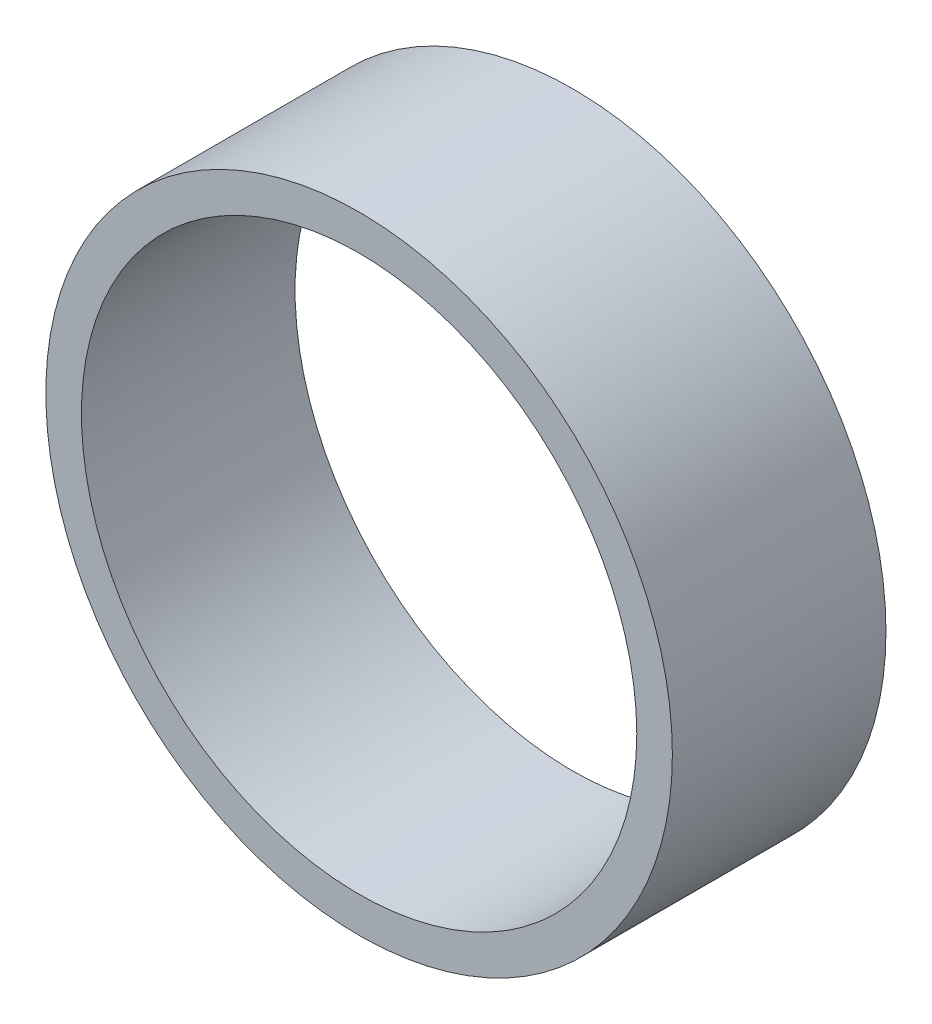
ISO-10303-21;
HEADER;
FILE_DESCRIPTION(('STEP AP214'),'2;1');
FILE_NAME('part.step','',(''),(''),'','','');
FILE_SCHEMA(('AUTOMOTIVE_DESIGN { 1 0 10303 214 1 1 1 1 }'));
ENDSEC;
DATA;
#1=APPLICATION_CONTEXT('core data for automotive mechanical design processes');
#2=APPLICATION_PROTOCOL_DEFINITION('international standard','automotive_design',2000,#1);
#3=PRODUCT_CONTEXT('',#1,'mechanical');
#4=PRODUCT('Part','Part','',(#3));
#5=PRODUCT_RELATED_PRODUCT_CATEGORY('part','',(#4));
#6=PRODUCT_DEFINITION_FORMATION('','',#4);
#7=PRODUCT_DEFINITION_CONTEXT('part definition',#1,'design');
#8=PRODUCT_DEFINITION('design','',#6,#7);
#9=PRODUCT_DEFINITION_SHAPE('','',#8);
#10=(LENGTH_UNIT() NAMED_UNIT(*) SI_UNIT(.MILLI.,.METRE.));
#11=(NAMED_UNIT(*) PLANE_ANGLE_UNIT() SI_UNIT($,.RADIAN.));
#12=(NAMED_UNIT(*) SI_UNIT($,.STERADIAN.) SOLID_ANGLE_UNIT());
#13=UNCERTAINTY_MEASURE_WITH_UNIT(LENGTH_MEASURE(1.E-05),#10,'distance_accuracy_value','');
#14=(GEOMETRIC_REPRESENTATION_CONTEXT(3) GLOBAL_UNCERTAINTY_ASSIGNED_CONTEXT((#13)) GLOBAL_UNIT_ASSIGNED_CONTEXT((#10,
#11,#12)) REPRESENTATION_CONTEXT('',''));
#15=CARTESIAN_POINT('',(0.,0.,0.));
#16=DIRECTION('',(0.,0.,1.));
#17=DIRECTION('',(1.,0.,0.));
#18=AXIS2_PLACEMENT_3D('',#15,#16,#17);
#19=CARTESIAN_POINT('',(0.,0.,30.));
#20=DIRECTION('',(0.,0.,1.));
#21=DIRECTION('',(1.,0.,0.));
#22=AXIS2_PLACEMENT_3D('',#19,#20,#21);
#23=PLANE('',#22);
#24=CARTESIAN_POINT('',(0.,0.,30.));
#25=DIRECTION('',(0.,0.,1.));
#26=DIRECTION('',(1.,0.,0.));
#27=AXIS2_PLACEMENT_3D('',#24,#25,#26);
#28=CIRCLE('',#27,44.);
#29=CARTESIAN_POINT('',(44.,0.,30.));
#30=VERTEX_POINT('',#29);
#31=EDGE_CURVE('E10',#30,#30,#28,.T.);
#32=ORIENTED_EDGE('',*,*,#31,.T.);
#33=EDGE_LOOP('',(#32));
#34=FACE_BOUND('',#33,.T.);
#35=CARTESIAN_POINT('',(0.,0.,30.));
#36=DIRECTION('',(0.,0.,1.));
#37=DIRECTION('',(1.,0.,0.));
#38=AXIS2_PLACEMENT_3D('',#35,#36,#37);
#39=CIRCLE('',#38,39.);
#40=CARTESIAN_POINT('',(39.,0.,30.));
#41=VERTEX_POINT('',#40);
#42=EDGE_CURVE('E41',#41,#41,#39,.T.);
#43=ORIENTED_EDGE('',*,*,#42,.F.);
#44=EDGE_LOOP('',(#43));
#45=FACE_BOUND('',#44,.T.);
#46=ADVANCED_FACE('F30',(#34,#45),#23,.T.);
#47=CARTESIAN_POINT('',(0.,0.,0.));
#48=DIRECTION('',(0.,0.,1.));
#49=DIRECTION('',(1.,0.,0.));
#50=AXIS2_PLACEMENT_3D('',#47,#48,#49);
#51=PLANE('',#50);
#52=CARTESIAN_POINT('',(0.,0.,0.));
#53=DIRECTION('',(0.,0.,1.));
#54=DIRECTION('',(1.,0.,0.));
#55=AXIS2_PLACEMENT_3D('',#52,#53,#54);
#56=CIRCLE('',#55,44.);
#57=CARTESIAN_POINT('',(44.,0.,0.));
#58=VERTEX_POINT('',#57);
#59=EDGE_CURVE('E34',#58,#58,#56,.T.);
#60=ORIENTED_EDGE('',*,*,#59,.F.);
#61=EDGE_LOOP('',(#60));
#62=FACE_BOUND('',#61,.T.);
#63=CARTESIAN_POINT('',(0.,0.,0.));
#64=DIRECTION('',(0.,0.,1.));
#65=DIRECTION('',(1.,0.,0.));
#66=AXIS2_PLACEMENT_3D('',#63,#64,#65);
#67=CIRCLE('',#66,39.);
#68=CARTESIAN_POINT('',(39.,0.,0.));
#69=VERTEX_POINT('',#68);
#70=EDGE_CURVE('E43',#69,#69,#67,.T.);
#71=ORIENTED_EDGE('',*,*,#70,.T.);
#72=EDGE_LOOP('',(#71));
#73=FACE_BOUND('',#72,.T.);
#74=ADVANCED_FACE('F53',(#62,#73),#51,.F.);
#75=CARTESIAN_POINT('',(0.,0.,30.));
#76=DIRECTION('',(0.,0.,-1.));
#77=DIRECTION('',(-1.,0.,0.));
#78=AXIS2_PLACEMENT_3D('',#75,#76,#77);
#79=CYLINDRICAL_SURFACE('',#78,44.);
#80=ORIENTED_EDGE('',*,*,#31,.F.);
#81=EDGE_LOOP('',(#80));
#82=FACE_BOUND('',#81,.T.);
#83=ORIENTED_EDGE('',*,*,#59,.T.);
#84=EDGE_LOOP('',(#83));
#85=FACE_BOUND('',#84,.T.);
#86=ADVANCED_FACE('F32',(#82,#85),#79,.T.);
#87=CARTESIAN_POINT('',(0.,0.,30.));
#88=DIRECTION('',(0.,0.,-1.));
#89=DIRECTION('',(-1.,0.,0.));
#90=AXIS2_PLACEMENT_3D('',#87,#88,#89);
#91=CYLINDRICAL_SURFACE('',#90,39.);
#92=ORIENTED_EDGE('',*,*,#42,.T.);
#93=EDGE_LOOP('',(#92));
#94=FACE_BOUND('',#93,.T.);
#95=ORIENTED_EDGE('',*,*,#70,.F.);
#96=EDGE_LOOP('',(#95));
#97=FACE_BOUND('',#96,.T.);
#98=ADVANCED_FACE('F49',(#94,#97),#91,.F.);
#99=CLOSED_SHELL('',(#46,#74,#86,#98));
#100=MANIFOLD_SOLID_BREP('B2',#99);
#101=ADVANCED_BREP_SHAPE_REPRESENTATION('',(#18,#100),#14);
#102=SHAPE_DEFINITION_REPRESENTATION(#9,#101);
ENDSEC;
END-ISO-10303-21;
